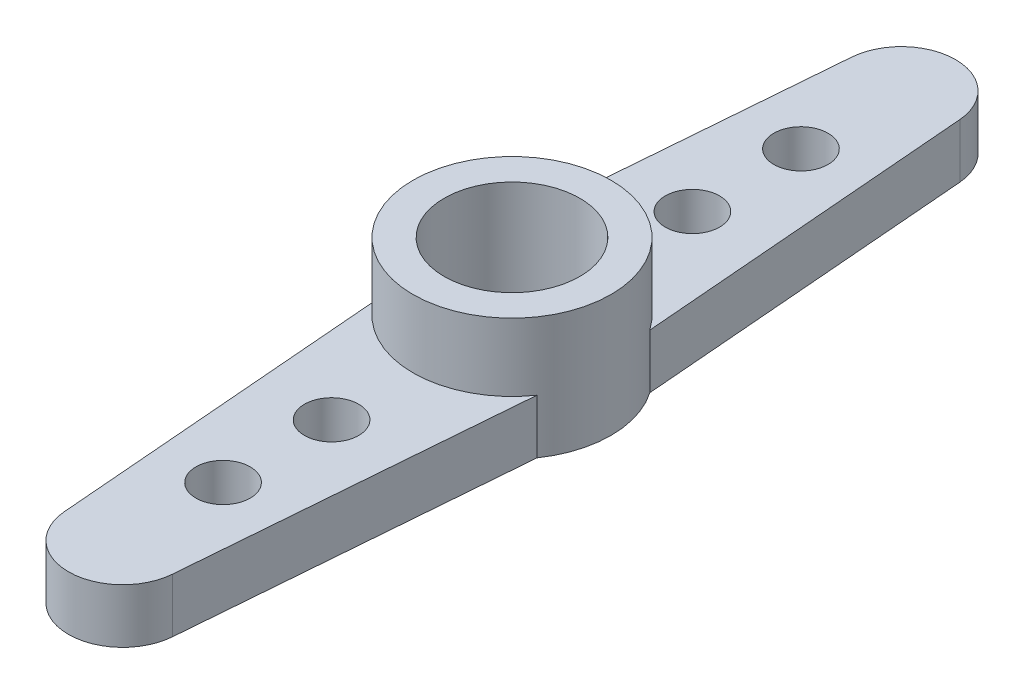
ISO-10303-21;
HEADER;
FILE_DESCRIPTION(('STEP AP214'),'2;1');
FILE_NAME('part.step','',(''),(''),'','','');
FILE_SCHEMA(('AUTOMOTIVE_DESIGN { 1 0 10303 214 1 1 1 1 }'));
ENDSEC;
DATA;
#1=APPLICATION_CONTEXT('core data for automotive mechanical design processes');
#2=APPLICATION_PROTOCOL_DEFINITION('international standard','automotive_design',2000,#1);
#3=PRODUCT_CONTEXT('',#1,'mechanical');
#4=PRODUCT('Part','Part','',(#3));
#5=PRODUCT_RELATED_PRODUCT_CATEGORY('part','',(#4));
#6=PRODUCT_DEFINITION_FORMATION('','',#4);
#7=PRODUCT_DEFINITION_CONTEXT('part definition',#1,'design');
#8=PRODUCT_DEFINITION('design','',#6,#7);
#9=PRODUCT_DEFINITION_SHAPE('','',#8);
#10=(LENGTH_UNIT() NAMED_UNIT(*) SI_UNIT(.MILLI.,.METRE.));
#11=(NAMED_UNIT(*) PLANE_ANGLE_UNIT() SI_UNIT($,.RADIAN.));
#12=(NAMED_UNIT(*) SI_UNIT($,.STERADIAN.) SOLID_ANGLE_UNIT());
#13=UNCERTAINTY_MEASURE_WITH_UNIT(LENGTH_MEASURE(1.E-05),#10,'distance_accuracy_value','');
#14=(GEOMETRIC_REPRESENTATION_CONTEXT(3) GLOBAL_UNCERTAINTY_ASSIGNED_CONTEXT((#13)) GLOBAL_UNIT_ASSIGNED_CONTEXT((#10,
#11,#12)) REPRESENTATION_CONTEXT('',''));
#15=CARTESIAN_POINT('',(0.,0.,0.));
#16=DIRECTION('',(0.,0.,1.));
#17=DIRECTION('',(1.,0.,0.));
#18=AXIS2_PLACEMENT_3D('',#15,#16,#17);
#19=CARTESIAN_POINT('',(0.,2.,0.));
#20=DIRECTION('',(0.,1.,0.));
#21=DIRECTION('',(0.,0.,1.));
#22=AXIS2_PLACEMENT_3D('',#19,#20,#21);
#23=PLANE('',#22);
#24=CARTESIAN_POINT('',(0.,2.,0.));
#25=DIRECTION('',(0.,1.,0.));
#26=DIRECTION('',(0.,0.,1.));
#27=AXIS2_PLACEMENT_3D('',#24,#25,#26);
#28=CIRCLE('',#27,3.65);
#29=CARTESIAN_POINT('',(-3.,2.,2.07906228862918));
#30=VERTEX_POINT('',#29);
#31=CARTESIAN_POINT('',(3.,2.,2.07906228862918));
#32=VERTEX_POINT('',#31);
#33=EDGE_CURVE('E11',#30,#32,#28,.T.);
#34=ORIENTED_EDGE('',*,*,#33,.F.);
#35=DIRECTION('',(0.0806960551621589,0.,0.996738755482732));
#36=VECTOR('',#35,1.);
#37=CARTESIAN_POINT('',(-1.99347751096547,2.,14.5113921103243));
#38=LINE('',#37,#36);
#39=CARTESIAN_POINT('',(-1.99347751096547,2.,14.5113921103243));
#40=VERTEX_POINT('',#39);
#41=EDGE_CURVE('E160',#30,#40,#38,.T.);
#42=ORIENTED_EDGE('',*,*,#41,.T.);
#43=CARTESIAN_POINT('',(0.,2.,14.35));
#44=DIRECTION('',(0.,1.,0.));
#45=DIRECTION('',(0.,0.,-1.));
#46=AXIS2_PLACEMENT_3D('',#43,#44,#45);
#47=CIRCLE('',#46,2.);
#48=CARTESIAN_POINT('',(1.99347751096547,2.,14.5113921103243));
#49=VERTEX_POINT('',#48);
#50=EDGE_CURVE('E157',#40,#49,#47,.T.);
#51=ORIENTED_EDGE('',*,*,#50,.T.);
#52=DIRECTION('',(0.0806960551621589,0.,-0.996738755482732));
#53=VECTOR('',#52,1.);
#54=CARTESIAN_POINT('',(3.,2.,2.07906228862918));
#55=LINE('',#54,#53);
#56=EDGE_CURVE('E159',#49,#32,#55,.T.);
#57=ORIENTED_EDGE('',*,*,#56,.T.);
#58=EDGE_LOOP('',(#34,#42,#51,#57));
#59=FACE_BOUND('',#58,.T.);
#60=CARTESIAN_POINT('',(0.,2.,10.65));
#61=DIRECTION('',(0.,1.,0.));
#62=DIRECTION('',(0.,0.,1.));
#63=AXIS2_PLACEMENT_3D('',#60,#61,#62);
#64=CIRCLE('',#63,1.);
#65=CARTESIAN_POINT('',(0.,2.,11.65));
#66=VERTEX_POINT('',#65);
#67=EDGE_CURVE('E145',#66,#66,#64,.T.);
#68=ORIENTED_EDGE('',*,*,#67,.F.);
#69=EDGE_LOOP('',(#68));
#70=FACE_BOUND('',#69,.T.);
#71=CARTESIAN_POINT('',(0.,2.,6.65));
#72=DIRECTION('',(0.,1.,0.));
#73=DIRECTION('',(0.,0.,1.));
#74=AXIS2_PLACEMENT_3D('',#71,#72,#73);
#75=CIRCLE('',#74,1.);
#76=CARTESIAN_POINT('',(0.,2.,7.65));
#77=VERTEX_POINT('',#76);
#78=EDGE_CURVE('E151',#77,#77,#75,.T.);
#79=ORIENTED_EDGE('',*,*,#78,.F.);
#80=EDGE_LOOP('',(#79));
#81=FACE_BOUND('',#80,.T.);
#82=ADVANCED_FACE('F32',(#59,#70,#81),#23,.T.);
#83=CARTESIAN_POINT('',(0.,0.,0.));
#84=DIRECTION('',(0.,1.,0.));
#85=DIRECTION('',(0.,0.,1.));
#86=AXIS2_PLACEMENT_3D('',#83,#84,#85);
#87=PLANE('',#86);
#88=CARTESIAN_POINT('',(0.,0.,10.65));
#89=DIRECTION('',(0.,1.,0.));
#90=DIRECTION('',(0.,0.,1.));
#91=AXIS2_PLACEMENT_3D('',#88,#89,#90);
#92=CIRCLE('',#91,1.);
#93=CARTESIAN_POINT('',(0.,0.,11.65));
#94=VERTEX_POINT('',#93);
#95=EDGE_CURVE('E144',#94,#94,#92,.T.);
#96=ORIENTED_EDGE('',*,*,#95,.T.);
#97=EDGE_LOOP('',(#96));
#98=FACE_BOUND('',#97,.T.);
#99=DIRECTION('',(0.0806960551621589,0.,0.996738755482732));
#100=VECTOR('',#99,1.);
#101=CARTESIAN_POINT('',(-1.99347751096547,0.,14.5113921103243));
#102=LINE('',#101,#100);
#103=CARTESIAN_POINT('',(-3.,0.,2.07906228862918));
#104=VERTEX_POINT('',#103);
#105=CARTESIAN_POINT('',(-1.99347751096547,0.,14.5113921103243));
#106=VERTEX_POINT('',#105);
#107=EDGE_CURVE('E163',#104,#106,#102,.T.);
#108=ORIENTED_EDGE('',*,*,#107,.F.);
#109=CARTESIAN_POINT('',(0.,0.,0.));
#110=DIRECTION('',(0.,1.,0.));
#111=DIRECTION('',(0.,0.,1.));
#112=AXIS2_PLACEMENT_3D('',#109,#110,#111);
#113=CIRCLE('',#112,3.65);
#114=CARTESIAN_POINT('',(-3.,0.,-2.07906228862918));
#115=VERTEX_POINT('',#114);
#116=EDGE_CURVE('E154',#115,#104,#113,.T.);
#117=ORIENTED_EDGE('',*,*,#116,.F.);
#118=DIRECTION('',(0.0806960551621589,0.,-0.996738755482732));
#119=VECTOR('',#118,1.);
#120=CARTESIAN_POINT('',(-1.99347751096547,0.,-14.5113921103243));
#121=LINE('',#120,#119);
#122=CARTESIAN_POINT('',(-1.99347751096547,0.,-14.5113921103243));
#123=VERTEX_POINT('',#122);
#124=EDGE_CURVE('E116',#115,#123,#121,.T.);
#125=ORIENTED_EDGE('',*,*,#124,.T.);
#126=CARTESIAN_POINT('',(0.,0.,-14.35));
#127=DIRECTION('',(0.,-1.,0.));
#128=DIRECTION('',(0.,0.,1.));
#129=AXIS2_PLACEMENT_3D('',#126,#127,#128);
#130=CIRCLE('',#129,2.);
#131=CARTESIAN_POINT('',(1.99347751096547,0.,-14.5113921103243));
#132=VERTEX_POINT('',#131);
#133=EDGE_CURVE('E126',#123,#132,#130,.T.);
#134=ORIENTED_EDGE('',*,*,#133,.T.);
#135=DIRECTION('',(0.0806960551621589,0.,0.996738755482732));
#136=VECTOR('',#135,1.);
#137=CARTESIAN_POINT('',(3.,0.,-2.07906228862918));
#138=LINE('',#137,#136);
#139=CARTESIAN_POINT('',(3.,0.,-2.07906228862918));
#140=VERTEX_POINT('',#139);
#141=EDGE_CURVE('E103',#132,#140,#138,.T.);
#142=ORIENTED_EDGE('',*,*,#141,.T.);
#143=CARTESIAN_POINT('',(3.,0.,2.07906228862918));
#144=VERTEX_POINT('',#143);
#145=EDGE_CURVE('E161',#144,#140,#113,.T.);
#146=ORIENTED_EDGE('',*,*,#145,.F.);
#147=DIRECTION('',(0.0806960551621589,0.,-0.996738755482732));
#148=VECTOR('',#147,1.);
#149=CARTESIAN_POINT('',(3.,0.,2.07906228862918));
#150=LINE('',#149,#148);
#151=CARTESIAN_POINT('',(1.99347751096547,0.,14.5113921103243));
#152=VERTEX_POINT('',#151);
#153=EDGE_CURVE('E167',#152,#144,#150,.T.);
#154=ORIENTED_EDGE('',*,*,#153,.F.);
#155=CARTESIAN_POINT('',(0.,0.,14.35));
#156=DIRECTION('',(0.,1.,0.));
#157=DIRECTION('',(0.,0.,-1.));
#158=AXIS2_PLACEMENT_3D('',#155,#156,#157);
#159=CIRCLE('',#158,2.);
#160=EDGE_CURVE('E165',#106,#152,#159,.T.);
#161=ORIENTED_EDGE('',*,*,#160,.F.);
#162=EDGE_LOOP('',(#108,#117,#125,#134,#142,#146,#154,#161));
#163=FACE_BOUND('',#162,.T.);
#164=CARTESIAN_POINT('',(0.,0.,6.65));
#165=DIRECTION('',(0.,1.,0.));
#166=DIRECTION('',(0.,0.,1.));
#167=AXIS2_PLACEMENT_3D('',#164,#165,#166);
#168=CIRCLE('',#167,1.);
#169=CARTESIAN_POINT('',(0.,0.,7.65));
#170=VERTEX_POINT('',#169);
#171=EDGE_CURVE('E148',#170,#170,#168,.T.);
#172=ORIENTED_EDGE('',*,*,#171,.T.);
#173=EDGE_LOOP('',(#172));
#174=FACE_BOUND('',#173,.T.);
#175=CARTESIAN_POINT('',(0.,0.,0.));
#176=DIRECTION('',(0.,1.,0.));
#177=DIRECTION('',(0.,0.,1.));
#178=AXIS2_PLACEMENT_3D('',#175,#176,#177);
#179=CIRCLE('',#178,2.5);
#180=CARTESIAN_POINT('',(0.,0.,2.5));
#181=VERTEX_POINT('',#180);
#182=EDGE_CURVE('E141',#181,#181,#179,.T.);
#183=ORIENTED_EDGE('',*,*,#182,.T.);
#184=EDGE_LOOP('',(#183));
#185=FACE_BOUND('',#184,.T.);
#186=CARTESIAN_POINT('',(0.,0.,-6.65));
#187=DIRECTION('',(0.,-1.,0.));
#188=DIRECTION('',(0.,0.,-1.));
#189=AXIS2_PLACEMENT_3D('',#186,#187,#188);
#190=CIRCLE('',#189,1.);
#191=CARTESIAN_POINT('',(0.,0.,-7.65));
#192=VERTEX_POINT('',#191);
#193=EDGE_CURVE('E319',#192,#192,#190,.T.);
#194=ORIENTED_EDGE('',*,*,#193,.F.);
#195=EDGE_LOOP('',(#194));
#196=FACE_BOUND('',#195,.T.);
#197=CARTESIAN_POINT('',(0.,0.,-10.65));
#198=DIRECTION('',(0.,-1.,0.));
#199=DIRECTION('',(0.,0.,-1.));
#200=AXIS2_PLACEMENT_3D('',#197,#198,#199);
#201=CIRCLE('',#200,1.);
#202=CARTESIAN_POINT('',(0.,0.,-11.65));
#203=VERTEX_POINT('',#202);
#204=EDGE_CURVE('E322',#203,#203,#201,.T.);
#205=ORIENTED_EDGE('',*,*,#204,.F.);
#206=EDGE_LOOP('',(#205));
#207=FACE_BOUND('',#206,.T.);
#208=ADVANCED_FACE('F197',(#98,#163,#174,#185,#196,#207),#87,.F.);
#209=CARTESIAN_POINT('',(0.,2.,0.));
#210=DIRECTION('',(0.,-1.,0.));
#211=DIRECTION('',(0.,0.,-1.));
#212=AXIS2_PLACEMENT_3D('',#209,#210,#211);
#213=CYLINDRICAL_SURFACE('',#212,3.65);
#214=ORIENTED_EDGE('',*,*,#33,.T.);
#215=DIRECTION('',(0.,-1.,0.));
#216=VECTOR('',#215,1.);
#217=CARTESIAN_POINT('',(3.,2.,2.07906228862918));
#218=LINE('',#217,#216);
#219=EDGE_CURVE('E173',#32,#144,#218,.T.);
#220=ORIENTED_EDGE('',*,*,#219,.T.);
#221=ORIENTED_EDGE('',*,*,#145,.T.);
#222=DIRECTION('',(0.,-1.,0.));
#223=VECTOR('',#222,1.);
#224=CARTESIAN_POINT('',(3.,2.,-2.07906228862918));
#225=LINE('',#224,#223);
#226=CARTESIAN_POINT('',(3.,2.,-2.07906228862918));
#227=VERTEX_POINT('',#226);
#228=EDGE_CURVE('E54',#227,#140,#225,.T.);
#229=ORIENTED_EDGE('',*,*,#228,.F.);
#230=CARTESIAN_POINT('',(0.,2.,0.));
#231=DIRECTION('',(0.,1.,0.));
#232=DIRECTION('',(0.,0.,1.));
#233=AXIS2_PLACEMENT_3D('',#230,#231,#232);
#234=CIRCLE('',#233,3.65);
#235=CARTESIAN_POINT('',(-3.,2.,-2.07906228862918));
#236=VERTEX_POINT('',#235);
#237=EDGE_CURVE('E49',#227,#236,#234,.T.);
#238=ORIENTED_EDGE('',*,*,#237,.T.);
#239=DIRECTION('',(0.,-1.,0.));
#240=VECTOR('',#239,1.);
#241=CARTESIAN_POINT('',(-3.,2.,-2.07906228862918));
#242=LINE('',#241,#240);
#243=EDGE_CURVE('E121',#236,#115,#242,.T.);
#244=ORIENTED_EDGE('',*,*,#243,.T.);
#245=ORIENTED_EDGE('',*,*,#116,.T.);
#246=DIRECTION('',(0.,-1.,0.));
#247=VECTOR('',#246,1.);
#248=CARTESIAN_POINT('',(-3.,2.,2.07906228862918));
#249=LINE('',#248,#247);
#250=EDGE_CURVE('E41',#30,#104,#249,.T.);
#251=ORIENTED_EDGE('',*,*,#250,.F.);
#252=EDGE_LOOP('',(#214,#220,#221,#229,#238,#244,#245,#251));
#253=FACE_BOUND('',#252,.T.);
#254=CARTESIAN_POINT('',(0.,4.5,0.));
#255=DIRECTION('',(0.,1.,0.));
#256=DIRECTION('',(0.,0.,1.));
#257=AXIS2_PLACEMENT_3D('',#254,#255,#256);
#258=CIRCLE('',#257,3.65);
#259=CARTESIAN_POINT('',(0.,4.5,3.65));
#260=VERTEX_POINT('',#259);
#261=EDGE_CURVE('E138',#260,#260,#258,.T.);
#262=ORIENTED_EDGE('',*,*,#261,.F.);
#263=EDGE_LOOP('',(#262));
#264=FACE_BOUND('',#263,.T.);
#265=ADVANCED_FACE('F34',(#253,#264),#213,.T.);
#266=CARTESIAN_POINT('',(-1.99347751096547,2.,14.5113921103243));
#267=DIRECTION('',(0.996738755482732,0.,-0.0806960551621589));
#268=DIRECTION('',(-0.0806960551621589,0.,-0.996738755482732));
#269=AXIS2_PLACEMENT_3D('',#266,#267,#268);
#270=PLANE('',#269);
#271=ORIENTED_EDGE('',*,*,#107,.T.);
#272=DIRECTION('',(0.,-1.,0.));
#273=VECTOR('',#272,1.);
#274=CARTESIAN_POINT('',(-1.99347751096547,2.,14.5113921103243));
#275=LINE('',#274,#273);
#276=EDGE_CURVE('E172',#40,#106,#275,.T.);
#277=ORIENTED_EDGE('',*,*,#276,.F.);
#278=ORIENTED_EDGE('',*,*,#41,.F.);
#279=ORIENTED_EDGE('',*,*,#250,.T.);
#280=EDGE_LOOP('',(#271,#277,#278,#279));
#281=FACE_BOUND('',#280,.T.);
#282=ADVANCED_FACE('F189',(#281),#270,.F.);
#283=CARTESIAN_POINT('',(0.,2.,14.35));
#284=DIRECTION('',(0.,-1.,0.));
#285=DIRECTION('',(0.,0.,-1.));
#286=AXIS2_PLACEMENT_3D('',#283,#284,#285);
#287=CYLINDRICAL_SURFACE('',#286,2.);
#288=ORIENTED_EDGE('',*,*,#160,.T.);
#289=DIRECTION('',(0.,-1.,0.));
#290=VECTOR('',#289,1.);
#291=CARTESIAN_POINT('',(1.99347751096547,2.,14.5113921103243));
#292=LINE('',#291,#290);
#293=EDGE_CURVE('E169',#49,#152,#292,.T.);
#294=ORIENTED_EDGE('',*,*,#293,.F.);
#295=ORIENTED_EDGE('',*,*,#50,.F.);
#296=ORIENTED_EDGE('',*,*,#276,.T.);
#297=EDGE_LOOP('',(#288,#294,#295,#296));
#298=FACE_BOUND('',#297,.T.);
#299=ADVANCED_FACE('F203',(#298),#287,.T.);
#300=CARTESIAN_POINT('',(3.,2.,2.07906228862918));
#301=DIRECTION('',(-0.996738755482732,0.,-0.0806960551621589));
#302=DIRECTION('',(-0.0806960551621589,0.,0.996738755482732));
#303=AXIS2_PLACEMENT_3D('',#300,#301,#302);
#304=PLANE('',#303);
#305=ORIENTED_EDGE('',*,*,#153,.T.);
#306=ORIENTED_EDGE('',*,*,#219,.F.);
#307=ORIENTED_EDGE('',*,*,#56,.F.);
#308=ORIENTED_EDGE('',*,*,#293,.T.);
#309=EDGE_LOOP('',(#305,#306,#307,#308));
#310=FACE_BOUND('',#309,.T.);
#311=ADVANCED_FACE('F207',(#310),#304,.F.);
#312=CARTESIAN_POINT('',(0.,2.,6.65));
#313=DIRECTION('',(0.,-1.,0.));
#314=DIRECTION('',(0.,0.,-1.));
#315=AXIS2_PLACEMENT_3D('',#312,#313,#314);
#316=CYLINDRICAL_SURFACE('',#315,1.);
#317=ORIENTED_EDGE('',*,*,#78,.T.);
#318=EDGE_LOOP('',(#317));
#319=FACE_BOUND('',#318,.T.);
#320=ORIENTED_EDGE('',*,*,#171,.F.);
#321=EDGE_LOOP('',(#320));
#322=FACE_BOUND('',#321,.T.);
#323=ADVANCED_FACE('F234',(#319,#322),#316,.F.);
#324=CARTESIAN_POINT('',(0.,2.,10.65));
#325=DIRECTION('',(0.,-1.,0.));
#326=DIRECTION('',(0.,0.,-1.));
#327=AXIS2_PLACEMENT_3D('',#324,#325,#326);
#328=CYLINDRICAL_SURFACE('',#327,1.);
#329=ORIENTED_EDGE('',*,*,#67,.T.);
#330=EDGE_LOOP('',(#329));
#331=FACE_BOUND('',#330,.T.);
#332=ORIENTED_EDGE('',*,*,#95,.F.);
#333=EDGE_LOOP('',(#332));
#334=FACE_BOUND('',#333,.T.);
#335=ADVANCED_FACE('F290',(#331,#334),#328,.F.);
#336=CARTESIAN_POINT('',(0.,2.,0.));
#337=DIRECTION('',(0.,-1.,0.));
#338=DIRECTION('',(0.,0.,-1.));
#339=AXIS2_PLACEMENT_3D('',#336,#337,#338);
#340=CYLINDRICAL_SURFACE('',#339,2.5);
#341=CARTESIAN_POINT('',(0.,4.5,0.));
#342=DIRECTION('',(0.,1.,0.));
#343=DIRECTION('',(0.,0.,1.));
#344=AXIS2_PLACEMENT_3D('',#341,#342,#343);
#345=CIRCLE('',#344,2.5);
#346=CARTESIAN_POINT('',(0.,4.5,2.5));
#347=VERTEX_POINT('',#346);
#348=EDGE_CURVE('E135',#347,#347,#345,.T.);
#349=ORIENTED_EDGE('',*,*,#348,.T.);
#350=EDGE_LOOP('',(#349));
#351=FACE_BOUND('',#350,.T.);
#352=ORIENTED_EDGE('',*,*,#182,.F.);
#353=EDGE_LOOP('',(#352));
#354=FACE_BOUND('',#353,.T.);
#355=ADVANCED_FACE('F263',(#351,#354),#340,.F.);
#356=CARTESIAN_POINT('',(0.,4.5,0.));
#357=DIRECTION('',(0.,1.,0.));
#358=DIRECTION('',(0.,0.,1.));
#359=AXIS2_PLACEMENT_3D('',#356,#357,#358);
#360=PLANE('',#359);
#361=ORIENTED_EDGE('',*,*,#261,.T.);
#362=EDGE_LOOP('',(#361));
#363=FACE_BOUND('',#362,.T.);
#364=ORIENTED_EDGE('',*,*,#348,.F.);
#365=EDGE_LOOP('',(#364));
#366=FACE_BOUND('',#365,.T.);
#367=ADVANCED_FACE('F259',(#363,#366),#360,.T.);
#368=CARTESIAN_POINT('',(0.,2.,0.));
#369=DIRECTION('',(0.,1.,0.));
#370=DIRECTION('',(0.,0.,-1.));
#371=AXIS2_PLACEMENT_3D('',#368,#369,#370);
#372=PLANE('',#371);
#373=CARTESIAN_POINT('',(0.,2.,-6.65));
#374=DIRECTION('',(0.,-1.,0.));
#375=DIRECTION('',(0.,0.,-1.));
#376=AXIS2_PLACEMENT_3D('',#373,#374,#375);
#377=CIRCLE('',#376,1.);
#378=CARTESIAN_POINT('',(0.,2.,-7.65));
#379=VERTEX_POINT('',#378);
#380=EDGE_CURVE('E127',#379,#379,#377,.T.);
#381=ORIENTED_EDGE('',*,*,#380,.T.);
#382=EDGE_LOOP('',(#381));
#383=FACE_BOUND('',#382,.T.);
#384=CARTESIAN_POINT('',(0.,2.,-10.65));
#385=DIRECTION('',(0.,-1.,0.));
#386=DIRECTION('',(0.,0.,-1.));
#387=AXIS2_PLACEMENT_3D('',#384,#385,#386);
#388=CIRCLE('',#387,1.);
#389=CARTESIAN_POINT('',(0.,2.,-11.65));
#390=VERTEX_POINT('',#389);
#391=EDGE_CURVE('E324',#390,#390,#388,.T.);
#392=ORIENTED_EDGE('',*,*,#391,.T.);
#393=EDGE_LOOP('',(#392));
#394=FACE_BOUND('',#393,.T.);
#395=ORIENTED_EDGE('',*,*,#237,.F.);
#396=DIRECTION('',(0.0806960551621589,0.,0.996738755482732));
#397=VECTOR('',#396,1.);
#398=CARTESIAN_POINT('',(3.,2.,-2.07906228862918));
#399=LINE('',#398,#397);
#400=CARTESIAN_POINT('',(1.99347751096547,2.,-14.5113921103243));
#401=VERTEX_POINT('',#400);
#402=EDGE_CURVE('E101',#401,#227,#399,.T.);
#403=ORIENTED_EDGE('',*,*,#402,.F.);
#404=CARTESIAN_POINT('',(0.,2.,-14.35));
#405=DIRECTION('',(0.,-1.,0.));
#406=DIRECTION('',(0.,0.,1.));
#407=AXIS2_PLACEMENT_3D('',#404,#405,#406);
#408=CIRCLE('',#407,2.);
#409=CARTESIAN_POINT('',(-1.99347751096547,2.,-14.5113921103243));
#410=VERTEX_POINT('',#409);
#411=EDGE_CURVE('E114',#410,#401,#408,.T.);
#412=ORIENTED_EDGE('',*,*,#411,.F.);
#413=DIRECTION('',(0.0806960551621589,0.,-0.996738755482732));
#414=VECTOR('',#413,1.);
#415=CARTESIAN_POINT('',(-1.99347751096547,2.,-14.5113921103243));
#416=LINE('',#415,#414);
#417=EDGE_CURVE('E119',#236,#410,#416,.T.);
#418=ORIENTED_EDGE('',*,*,#417,.F.);
#419=EDGE_LOOP('',(#395,#403,#412,#418));
#420=FACE_BOUND('',#419,.T.);
#421=ADVANCED_FACE('F112',(#383,#394,#420),#372,.T.);
#422=CARTESIAN_POINT('',(3.,2.,-2.07906228862918));
#423=DIRECTION('',(0.996738755482732,0.,-0.0806960551621589));
#424=DIRECTION('',(-0.0806960551621589,0.,-0.996738755482732));
#425=AXIS2_PLACEMENT_3D('',#422,#423,#424);
#426=PLANE('',#425);
#427=ORIENTED_EDGE('',*,*,#141,.F.);
#428=DIRECTION('',(0.,-1.,0.));
#429=VECTOR('',#428,1.);
#430=CARTESIAN_POINT('',(1.99347751096547,2.,-14.5113921103243));
#431=LINE('',#430,#429);
#432=EDGE_CURVE('E98',#401,#132,#431,.T.);
#433=ORIENTED_EDGE('',*,*,#432,.F.);
#434=ORIENTED_EDGE('',*,*,#402,.T.);
#435=ORIENTED_EDGE('',*,*,#228,.T.);
#436=EDGE_LOOP('',(#427,#433,#434,#435));
#437=FACE_BOUND('',#436,.T.);
#438=ADVANCED_FACE('F100',(#437),#426,.T.);
#439=CARTESIAN_POINT('',(0.,2.,-14.35));
#440=DIRECTION('',(0.,-1.,0.));
#441=DIRECTION('',(0.,0.,-1.));
#442=AXIS2_PLACEMENT_3D('',#439,#440,#441);
#443=CYLINDRICAL_SURFACE('',#442,2.);
#444=ORIENTED_EDGE('',*,*,#133,.F.);
#445=DIRECTION('',(0.,-1.,0.));
#446=VECTOR('',#445,1.);
#447=CARTESIAN_POINT('',(-1.99347751096547,2.,-14.5113921103243));
#448=LINE('',#447,#446);
#449=EDGE_CURVE('E108',#410,#123,#448,.T.);
#450=ORIENTED_EDGE('',*,*,#449,.F.);
#451=ORIENTED_EDGE('',*,*,#411,.T.);
#452=ORIENTED_EDGE('',*,*,#432,.T.);
#453=EDGE_LOOP('',(#444,#450,#451,#452));
#454=FACE_BOUND('',#453,.T.);
#455=ADVANCED_FACE('F118',(#454),#443,.T.);
#456=CARTESIAN_POINT('',(-1.99347751096547,2.,-14.5113921103243));
#457=DIRECTION('',(-0.996738755482732,0.,-0.0806960551621589));
#458=DIRECTION('',(-0.0806960551621589,0.,0.996738755482732));
#459=AXIS2_PLACEMENT_3D('',#456,#457,#458);
#460=PLANE('',#459);
#461=ORIENTED_EDGE('',*,*,#124,.F.);
#462=ORIENTED_EDGE('',*,*,#243,.F.);
#463=ORIENTED_EDGE('',*,*,#417,.T.);
#464=ORIENTED_EDGE('',*,*,#449,.T.);
#465=EDGE_LOOP('',(#461,#462,#463,#464));
#466=FACE_BOUND('',#465,.T.);
#467=ADVANCED_FACE('F212',(#466),#460,.T.);
#468=CARTESIAN_POINT('',(0.,2.,-6.65));
#469=DIRECTION('',(0.,-1.,0.));
#470=DIRECTION('',(0.,0.,-1.));
#471=AXIS2_PLACEMENT_3D('',#468,#469,#470);
#472=CYLINDRICAL_SURFACE('',#471,1.);
#473=ORIENTED_EDGE('',*,*,#380,.F.);
#474=EDGE_LOOP('',(#473));
#475=FACE_BOUND('',#474,.T.);
#476=ORIENTED_EDGE('',*,*,#193,.T.);
#477=EDGE_LOOP('',(#476));
#478=FACE_BOUND('',#477,.T.);
#479=ADVANCED_FACE('F214',(#475,#478),#472,.F.);
#480=CARTESIAN_POINT('',(0.,2.,-10.65));
#481=DIRECTION('',(0.,-1.,0.));
#482=DIRECTION('',(0.,0.,-1.));
#483=AXIS2_PLACEMENT_3D('',#480,#481,#482);
#484=CYLINDRICAL_SURFACE('',#483,1.);
#485=ORIENTED_EDGE('',*,*,#391,.F.);
#486=EDGE_LOOP('',(#485));
#487=FACE_BOUND('',#486,.T.);
#488=ORIENTED_EDGE('',*,*,#204,.T.);
#489=EDGE_LOOP('',(#488));
#490=FACE_BOUND('',#489,.T.);
#491=ADVANCED_FACE('F220',(#487,#490),#484,.F.);
#492=CLOSED_SHELL('',(#82,#208,#265,#282,#299,#311,#323,#335,#355,#367,#421,#438,#455,#467,#479,#491));
#493=MANIFOLD_SOLID_BREP('B2',#492);
#494=ADVANCED_BREP_SHAPE_REPRESENTATION('',(#18,#493),#14);
#495=SHAPE_DEFINITION_REPRESENTATION(#9,#494);
ENDSEC;
END-ISO-10303-21;
